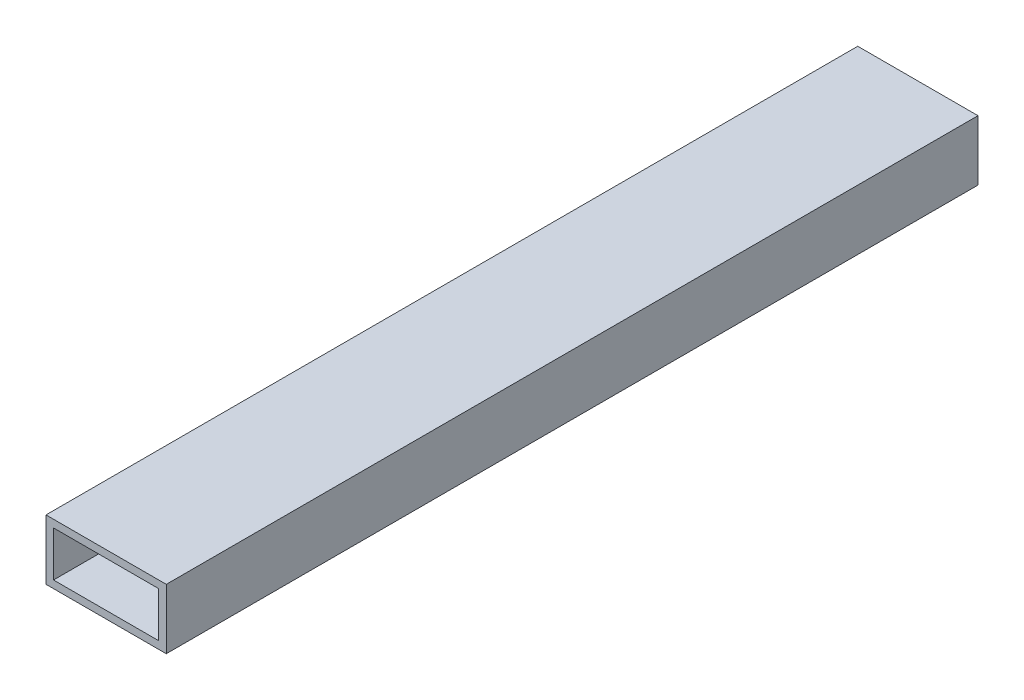
ISO-10303-21;
HEADER;
FILE_DESCRIPTION(('STEP AP214'),'2;1');
FILE_NAME('part.step','',(''),(''),'','','');
FILE_SCHEMA(('AUTOMOTIVE_DESIGN { 1 0 10303 214 1 1 1 1 }'));
ENDSEC;
DATA;
#1=APPLICATION_CONTEXT('core data for automotive mechanical design processes');
#2=APPLICATION_PROTOCOL_DEFINITION('international standard','automotive_design',2000,#1);
#3=PRODUCT_CONTEXT('',#1,'mechanical');
#4=PRODUCT('Part','Part','',(#3));
#5=PRODUCT_RELATED_PRODUCT_CATEGORY('part','',(#4));
#6=PRODUCT_DEFINITION_FORMATION('','',#4);
#7=PRODUCT_DEFINITION_CONTEXT('part definition',#1,'design');
#8=PRODUCT_DEFINITION('design','',#6,#7);
#9=PRODUCT_DEFINITION_SHAPE('','',#8);
#10=(LENGTH_UNIT() NAMED_UNIT(*) SI_UNIT(.MILLI.,.METRE.));
#11=(NAMED_UNIT(*) PLANE_ANGLE_UNIT() SI_UNIT($,.RADIAN.));
#12=(NAMED_UNIT(*) SI_UNIT($,.STERADIAN.) SOLID_ANGLE_UNIT());
#13=UNCERTAINTY_MEASURE_WITH_UNIT(LENGTH_MEASURE(1.E-05),#10,'distance_accuracy_value','');
#14=(GEOMETRIC_REPRESENTATION_CONTEXT(3) GLOBAL_UNCERTAINTY_ASSIGNED_CONTEXT((#13)) GLOBAL_UNIT_ASSIGNED_CONTEXT((#10,
#11,#12)) REPRESENTATION_CONTEXT('',''));
#15=CARTESIAN_POINT('',(0.,0.,0.));
#16=DIRECTION('',(0.,0.,1.));
#17=DIRECTION('',(1.,0.,0.));
#18=AXIS2_PLACEMENT_3D('',#15,#16,#17);
#19=CARTESIAN_POINT('',(22.225,9.525,0.));
#20=DIRECTION('',(1.,0.,0.));
#21=DIRECTION('',(0.,0.,-1.));
#22=AXIS2_PLACEMENT_3D('',#19,#20,#21);
#23=PLANE('',#22);
#24=DIRECTION('',(0.,-1.,0.));
#25=VECTOR('',#24,1.);
#26=CARTESIAN_POINT('',(22.225,4.7625,171.45));
#27=LINE('',#26,#25);
#28=CARTESIAN_POINT('',(22.225,9.525,171.45));
#29=VERTEX_POINT('',#28);
#30=CARTESIAN_POINT('',(22.225,-9.525,171.45));
#31=VERTEX_POINT('',#30);
#32=EDGE_CURVE('E33',#29,#31,#27,.T.);
#33=ORIENTED_EDGE('',*,*,#32,.F.);
#34=DIRECTION('',(0.,0.,-1.));
#35=VECTOR('',#34,1.);
#36=CARTESIAN_POINT('',(22.225,9.525,0.));
#37=LINE('',#36,#35);
#38=CARTESIAN_POINT('',(22.225,9.525,-171.45));
#39=VERTEX_POINT('',#38);
#40=EDGE_CURVE('E9',#29,#39,#37,.T.);
#41=ORIENTED_EDGE('',*,*,#40,.T.);
#42=DIRECTION('',(0.,1.,0.));
#43=VECTOR('',#42,1.);
#44=CARTESIAN_POINT('',(22.225,4.7625,-171.45));
#45=LINE('',#44,#43);
#46=CARTESIAN_POINT('',(22.225,-9.525,-171.45));
#47=VERTEX_POINT('',#46);
#48=EDGE_CURVE('E174',#47,#39,#45,.T.);
#49=ORIENTED_EDGE('',*,*,#48,.F.);
#50=DIRECTION('',(0.,0.,1.));
#51=VECTOR('',#50,1.);
#52=CARTESIAN_POINT('',(22.225,-9.525,0.));
#53=LINE('',#52,#51);
#54=EDGE_CURVE('E25',#47,#31,#53,.T.);
#55=ORIENTED_EDGE('',*,*,#54,.T.);
#56=EDGE_LOOP('',(#33,#41,#49,#55));
#57=FACE_BOUND('',#56,.T.);
#58=ADVANCED_FACE('F15',(#57),#23,.F.);
#59=CARTESIAN_POINT('',(22.225,-9.525,0.));
#60=DIRECTION('',(0.,-1.,0.));
#61=DIRECTION('',(0.,0.,-1.));
#62=AXIS2_PLACEMENT_3D('',#59,#60,#61);
#63=PLANE('',#62);
#64=DIRECTION('',(-1.,0.,0.));
#65=VECTOR('',#64,1.);
#66=CARTESIAN_POINT('',(11.1125,-9.525,171.45));
#67=LINE('',#66,#65);
#68=CARTESIAN_POINT('',(-22.225,-9.525,171.45));
#69=VERTEX_POINT('',#68);
#70=EDGE_CURVE('E165',#31,#69,#67,.T.);
#71=ORIENTED_EDGE('',*,*,#70,.F.);
#72=ORIENTED_EDGE('',*,*,#54,.F.);
#73=DIRECTION('',(1.,0.,0.));
#74=VECTOR('',#73,1.);
#75=CARTESIAN_POINT('',(11.1125,-9.525,-171.45));
#76=LINE('',#75,#74);
#77=CARTESIAN_POINT('',(-22.225,-9.525,-171.45));
#78=VERTEX_POINT('',#77);
#79=EDGE_CURVE('E116',#78,#47,#76,.T.);
#80=ORIENTED_EDGE('',*,*,#79,.F.);
#81=DIRECTION('',(0.,0.,1.));
#82=VECTOR('',#81,1.);
#83=CARTESIAN_POINT('',(-22.225,-9.525,0.));
#84=LINE('',#83,#82);
#85=EDGE_CURVE('E158',#78,#69,#84,.T.);
#86=ORIENTED_EDGE('',*,*,#85,.T.);
#87=EDGE_LOOP('',(#71,#72,#80,#86));
#88=FACE_BOUND('',#87,.T.);
#89=ADVANCED_FACE('F141',(#88),#63,.F.);
#90=CARTESIAN_POINT('',(-22.225,-9.525,0.));
#91=DIRECTION('',(-1.,0.,0.));
#92=DIRECTION('',(0.,0.,1.));
#93=AXIS2_PLACEMENT_3D('',#90,#91,#92);
#94=PLANE('',#93);
#95=DIRECTION('',(0.,1.,0.));
#96=VECTOR('',#95,1.);
#97=CARTESIAN_POINT('',(-22.225,-4.7625,171.45));
#98=LINE('',#97,#96);
#99=CARTESIAN_POINT('',(-22.225,9.525,171.45));
#100=VERTEX_POINT('',#99);
#101=EDGE_CURVE('E156',#69,#100,#98,.T.);
#102=ORIENTED_EDGE('',*,*,#101,.F.);
#103=ORIENTED_EDGE('',*,*,#85,.F.);
#104=DIRECTION('',(0.,-1.,0.));
#105=VECTOR('',#104,1.);
#106=CARTESIAN_POINT('',(-22.225,-4.7625,-171.45));
#107=LINE('',#106,#105);
#108=CARTESIAN_POINT('',(-22.225,9.525,-171.45));
#109=VERTEX_POINT('',#108);
#110=EDGE_CURVE('E120',#109,#78,#107,.T.);
#111=ORIENTED_EDGE('',*,*,#110,.F.);
#112=DIRECTION('',(0.,0.,1.));
#113=VECTOR('',#112,1.);
#114=CARTESIAN_POINT('',(-22.225,9.525,0.));
#115=LINE('',#114,#113);
#116=EDGE_CURVE('E161',#109,#100,#115,.T.);
#117=ORIENTED_EDGE('',*,*,#116,.T.);
#118=EDGE_LOOP('',(#102,#103,#111,#117));
#119=FACE_BOUND('',#118,.T.);
#120=ADVANCED_FACE('F137',(#119),#94,.F.);
#121=CARTESIAN_POINT('',(-22.225,9.525,0.));
#122=DIRECTION('',(0.,1.,0.));
#123=DIRECTION('',(0.,0.,1.));
#124=AXIS2_PLACEMENT_3D('',#121,#122,#123);
#125=PLANE('',#124);
#126=DIRECTION('',(1.,0.,0.));
#127=VECTOR('',#126,1.);
#128=CARTESIAN_POINT('',(-11.1125,9.525,171.45));
#129=LINE('',#128,#127);
#130=EDGE_CURVE('E166',#100,#29,#129,.T.);
#131=ORIENTED_EDGE('',*,*,#130,.F.);
#132=ORIENTED_EDGE('',*,*,#116,.F.);
#133=DIRECTION('',(-1.,0.,0.));
#134=VECTOR('',#133,1.);
#135=CARTESIAN_POINT('',(-11.1125,9.525,-171.45));
#136=LINE('',#135,#134);
#137=EDGE_CURVE('E173',#39,#109,#136,.T.);
#138=ORIENTED_EDGE('',*,*,#137,.F.);
#139=ORIENTED_EDGE('',*,*,#40,.F.);
#140=EDGE_LOOP('',(#131,#132,#138,#139));
#141=FACE_BOUND('',#140,.T.);
#142=ADVANCED_FACE('F127',(#141),#125,.F.);
#143=CARTESIAN_POINT('',(0.,0.,-171.45));
#144=DIRECTION('',(0.,0.,1.));
#145=DIRECTION('',(1.,0.,0.));
#146=AXIS2_PLACEMENT_3D('',#143,#144,#145);
#147=PLANE('',#146);
#148=ORIENTED_EDGE('',*,*,#48,.T.);
#149=ORIENTED_EDGE('',*,*,#137,.T.);
#150=ORIENTED_EDGE('',*,*,#110,.T.);
#151=ORIENTED_EDGE('',*,*,#79,.T.);
#152=EDGE_LOOP('',(#148,#149,#150,#151));
#153=FACE_BOUND('',#152,.T.);
#154=DIRECTION('',(0.,-1.,0.));
#155=VECTOR('',#154,1.);
#156=CARTESIAN_POINT('',(-25.4,-12.7,-171.45));
#157=LINE('',#156,#155);
#158=CARTESIAN_POINT('',(-25.4,12.7,-171.45));
#159=VERTEX_POINT('',#158);
#160=CARTESIAN_POINT('',(-25.4,-12.7,-171.45));
#161=VERTEX_POINT('',#160);
#162=EDGE_CURVE('E95',#159,#161,#157,.T.);
#163=ORIENTED_EDGE('',*,*,#162,.F.);
#164=DIRECTION('',(-1.,0.,0.));
#165=VECTOR('',#164,1.);
#166=CARTESIAN_POINT('',(-25.4,12.7,-171.45));
#167=LINE('',#166,#165);
#168=CARTESIAN_POINT('',(25.4,12.7,-171.45));
#169=VERTEX_POINT('',#168);
#170=EDGE_CURVE('E87',#169,#159,#167,.T.);
#171=ORIENTED_EDGE('',*,*,#170,.F.);
#172=DIRECTION('',(0.,1.,0.));
#173=VECTOR('',#172,1.);
#174=CARTESIAN_POINT('',(25.4,12.7,-171.45));
#175=LINE('',#174,#173);
#176=CARTESIAN_POINT('',(25.4,-12.7,-171.45));
#177=VERTEX_POINT('',#176);
#178=EDGE_CURVE('E110',#177,#169,#175,.T.);
#179=ORIENTED_EDGE('',*,*,#178,.F.);
#180=DIRECTION('',(1.,0.,0.));
#181=VECTOR('',#180,1.);
#182=CARTESIAN_POINT('',(25.4,-12.7,-171.45));
#183=LINE('',#182,#181);
#184=EDGE_CURVE('E94',#161,#177,#183,.T.);
#185=ORIENTED_EDGE('',*,*,#184,.F.);
#186=EDGE_LOOP('',(#163,#171,#179,#185));
#187=FACE_BOUND('',#186,.T.);
#188=ADVANCED_FACE('F125',(#153,#187),#147,.F.);
#189=CARTESIAN_POINT('',(25.4,12.7,0.));
#190=DIRECTION('',(1.,0.,0.));
#191=DIRECTION('',(0.,0.,-1.));
#192=AXIS2_PLACEMENT_3D('',#189,#190,#191);
#193=PLANE('',#192);
#194=DIRECTION('',(0.,-1.,0.));
#195=VECTOR('',#194,1.);
#196=CARTESIAN_POINT('',(25.4,12.7,171.45));
#197=LINE('',#196,#195);
#198=CARTESIAN_POINT('',(25.4,12.7,171.45));
#199=VERTEX_POINT('',#198);
#200=CARTESIAN_POINT('',(25.4,-12.7,171.45));
#201=VERTEX_POINT('',#200);
#202=EDGE_CURVE('E99',#199,#201,#197,.T.);
#203=ORIENTED_EDGE('',*,*,#202,.T.);
#204=DIRECTION('',(0.,0.,-1.));
#205=VECTOR('',#204,1.);
#206=CARTESIAN_POINT('',(25.4,-12.7,0.));
#207=LINE('',#206,#205);
#208=EDGE_CURVE('E106',#201,#177,#207,.T.);
#209=ORIENTED_EDGE('',*,*,#208,.T.);
#210=ORIENTED_EDGE('',*,*,#178,.T.);
#211=DIRECTION('',(0.,0.,-1.));
#212=VECTOR('',#211,1.);
#213=CARTESIAN_POINT('',(25.4,12.7,0.));
#214=LINE('',#213,#212);
#215=EDGE_CURVE('E100',#199,#169,#214,.T.);
#216=ORIENTED_EDGE('',*,*,#215,.F.);
#217=EDGE_LOOP('',(#203,#209,#210,#216));
#218=FACE_BOUND('',#217,.T.);
#219=ADVANCED_FACE('F123',(#218),#193,.T.);
#220=CARTESIAN_POINT('',(25.4,-12.7,0.));
#221=DIRECTION('',(0.,-1.,0.));
#222=DIRECTION('',(0.,0.,-1.));
#223=AXIS2_PLACEMENT_3D('',#220,#221,#222);
#224=PLANE('',#223);
#225=DIRECTION('',(-1.,0.,0.));
#226=VECTOR('',#225,1.);
#227=CARTESIAN_POINT('',(25.4,-12.7,171.45));
#228=LINE('',#227,#226);
#229=CARTESIAN_POINT('',(-25.4,-12.7,171.45));
#230=VERTEX_POINT('',#229);
#231=EDGE_CURVE('E108',#201,#230,#228,.T.);
#232=ORIENTED_EDGE('',*,*,#231,.T.);
#233=DIRECTION('',(0.,0.,-1.));
#234=VECTOR('',#233,1.);
#235=CARTESIAN_POINT('',(-25.4,-12.7,0.));
#236=LINE('',#235,#234);
#237=EDGE_CURVE('E77',#230,#161,#236,.T.);
#238=ORIENTED_EDGE('',*,*,#237,.T.);
#239=ORIENTED_EDGE('',*,*,#184,.T.);
#240=ORIENTED_EDGE('',*,*,#208,.F.);
#241=EDGE_LOOP('',(#232,#238,#239,#240));
#242=FACE_BOUND('',#241,.T.);
#243=ADVANCED_FACE('F135',(#242),#224,.T.);
#244=CARTESIAN_POINT('',(-25.4,-12.7,0.));
#245=DIRECTION('',(-1.,0.,0.));
#246=DIRECTION('',(0.,0.,1.));
#247=AXIS2_PLACEMENT_3D('',#244,#245,#246);
#248=PLANE('',#247);
#249=DIRECTION('',(0.,1.,0.));
#250=VECTOR('',#249,1.);
#251=CARTESIAN_POINT('',(-25.4,-12.7,171.45));
#252=LINE('',#251,#250);
#253=CARTESIAN_POINT('',(-25.4,12.7,171.45));
#254=VERTEX_POINT('',#253);
#255=EDGE_CURVE('E90',#230,#254,#252,.T.);
#256=ORIENTED_EDGE('',*,*,#255,.T.);
#257=DIRECTION('',(0.,0.,1.));
#258=VECTOR('',#257,1.);
#259=CARTESIAN_POINT('',(-25.4,12.7,0.));
#260=LINE('',#259,#258);
#261=EDGE_CURVE('E83',#159,#254,#260,.T.);
#262=ORIENTED_EDGE('',*,*,#261,.F.);
#263=ORIENTED_EDGE('',*,*,#162,.T.);
#264=ORIENTED_EDGE('',*,*,#237,.F.);
#265=EDGE_LOOP('',(#256,#262,#263,#264));
#266=FACE_BOUND('',#265,.T.);
#267=ADVANCED_FACE('F91',(#266),#248,.T.);
#268=CARTESIAN_POINT('',(-25.4,12.7,0.));
#269=DIRECTION('',(0.,1.,0.));
#270=DIRECTION('',(0.,0.,1.));
#271=AXIS2_PLACEMENT_3D('',#268,#269,#270);
#272=PLANE('',#271);
#273=DIRECTION('',(1.,0.,0.));
#274=VECTOR('',#273,1.);
#275=CARTESIAN_POINT('',(-25.4,12.7,171.45));
#276=LINE('',#275,#274);
#277=EDGE_CURVE('E19',#254,#199,#276,.T.);
#278=ORIENTED_EDGE('',*,*,#277,.T.);
#279=ORIENTED_EDGE('',*,*,#215,.T.);
#280=ORIENTED_EDGE('',*,*,#170,.T.);
#281=ORIENTED_EDGE('',*,*,#261,.T.);
#282=EDGE_LOOP('',(#278,#279,#280,#281));
#283=FACE_BOUND('',#282,.T.);
#284=ADVANCED_FACE('F84',(#283),#272,.T.);
#285=CARTESIAN_POINT('',(0.,0.,171.45));
#286=DIRECTION('',(0.,0.,1.));
#287=DIRECTION('',(1.,0.,0.));
#288=AXIS2_PLACEMENT_3D('',#285,#286,#287);
#289=PLANE('',#288);
#290=ORIENTED_EDGE('',*,*,#32,.T.);
#291=ORIENTED_EDGE('',*,*,#70,.T.);
#292=ORIENTED_EDGE('',*,*,#101,.T.);
#293=ORIENTED_EDGE('',*,*,#130,.T.);
#294=EDGE_LOOP('',(#290,#291,#292,#293));
#295=FACE_BOUND('',#294,.T.);
#296=ORIENTED_EDGE('',*,*,#202,.F.);
#297=ORIENTED_EDGE('',*,*,#277,.F.);
#298=ORIENTED_EDGE('',*,*,#255,.F.);
#299=ORIENTED_EDGE('',*,*,#231,.F.);
#300=EDGE_LOOP('',(#296,#297,#298,#299));
#301=FACE_BOUND('',#300,.T.);
#302=ADVANCED_FACE('F17',(#295,#301),#289,.T.);
#303=CLOSED_SHELL('',(#58,#89,#120,#142,#188,#219,#243,#267,#284,#302));
#304=MANIFOLD_SOLID_BREP('B1',#303);
#305=ADVANCED_BREP_SHAPE_REPRESENTATION('',(#18,#304),#14);
#306=SHAPE_DEFINITION_REPRESENTATION(#9,#305);
ENDSEC;
END-ISO-10303-21;
